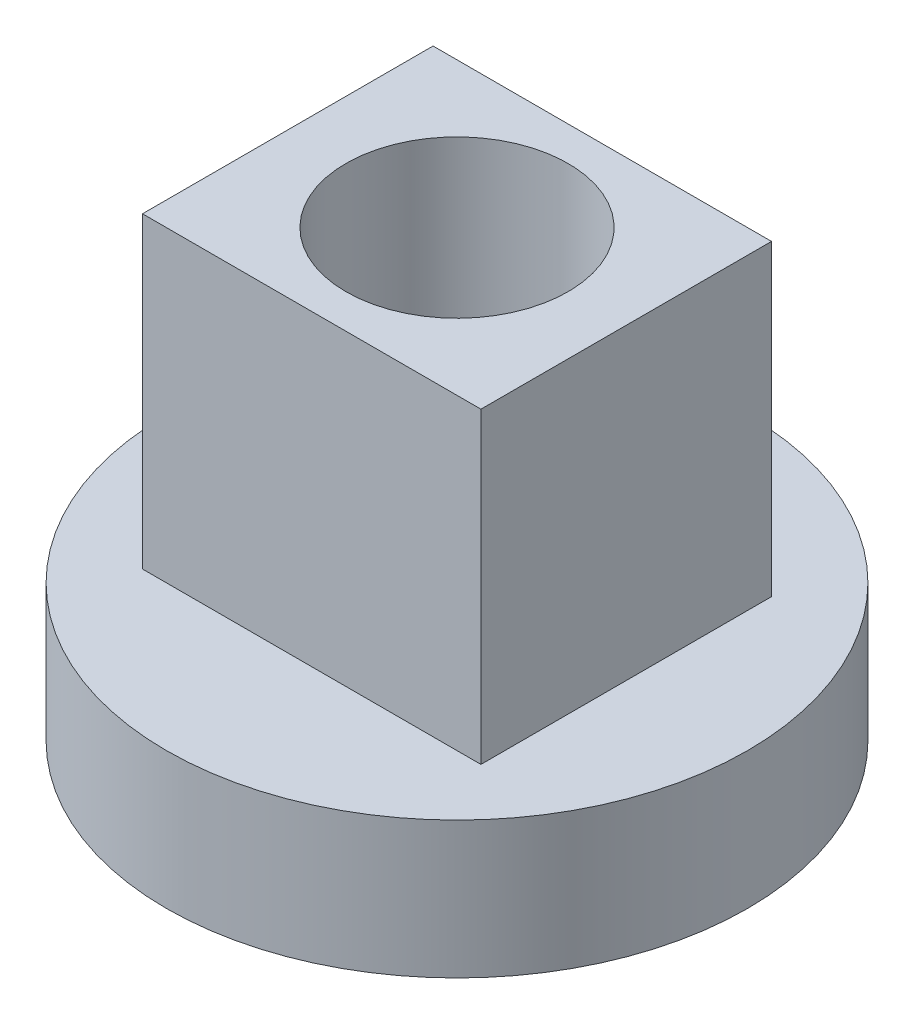
ISO-10303-21;
HEADER;
FILE_DESCRIPTION(('STEP AP214'),'2;1');
FILE_NAME('part.step','',(''),(''),'','','');
FILE_SCHEMA(('AUTOMOTIVE_DESIGN { 1 0 10303 214 1 1 1 1 }'));
ENDSEC;
DATA;
#1=APPLICATION_CONTEXT('core data for automotive mechanical design processes');
#2=APPLICATION_PROTOCOL_DEFINITION('international standard','automotive_design',2000,#1);
#3=PRODUCT_CONTEXT('',#1,'mechanical');
#4=PRODUCT('Part','Part','',(#3));
#5=PRODUCT_RELATED_PRODUCT_CATEGORY('part','',(#4));
#6=PRODUCT_DEFINITION_FORMATION('','',#4);
#7=PRODUCT_DEFINITION_CONTEXT('part definition',#1,'design');
#8=PRODUCT_DEFINITION('design','',#6,#7);
#9=PRODUCT_DEFINITION_SHAPE('','',#8);
#10=(LENGTH_UNIT() NAMED_UNIT(*) SI_UNIT(.MILLI.,.METRE.));
#11=(NAMED_UNIT(*) PLANE_ANGLE_UNIT() SI_UNIT($,.RADIAN.));
#12=(NAMED_UNIT(*) SI_UNIT($,.STERADIAN.) SOLID_ANGLE_UNIT());
#13=UNCERTAINTY_MEASURE_WITH_UNIT(LENGTH_MEASURE(1.E-05),#10,'distance_accuracy_value','');
#14=(GEOMETRIC_REPRESENTATION_CONTEXT(3) GLOBAL_UNCERTAINTY_ASSIGNED_CONTEXT((#13)) GLOBAL_UNIT_ASSIGNED_CONTEXT((#10,
#11,#12)) REPRESENTATION_CONTEXT('',''));
#15=CARTESIAN_POINT('',(0.,0.,0.));
#16=DIRECTION('',(0.,0.,1.));
#17=DIRECTION('',(1.,0.,0.));
#18=AXIS2_PLACEMENT_3D('',#15,#16,#17);
#19=CARTESIAN_POINT('',(0.,2.032,0.));
#20=DIRECTION('',(0.,-1.,0.));
#21=DIRECTION('',(0.,0.,-1.));
#22=AXIS2_PLACEMENT_3D('',#19,#20,#21);
#23=CYLINDRICAL_SURFACE('',#22,4.318);
#24=CARTESIAN_POINT('',(0.,2.032,0.));
#25=DIRECTION('',(0.,1.,0.));
#26=DIRECTION('',(0.,0.,1.));
#27=AXIS2_PLACEMENT_3D('',#24,#25,#26);
#28=CIRCLE('',#27,4.318);
#29=CARTESIAN_POINT('',(0.,2.032,4.318));
#30=VERTEX_POINT('',#29);
#31=EDGE_CURVE('E11',#30,#30,#28,.T.);
#32=ORIENTED_EDGE('',*,*,#31,.F.);
#33=EDGE_LOOP('',(#32));
#34=FACE_BOUND('',#33,.T.);
#35=CARTESIAN_POINT('',(0.,0.,0.));
#36=DIRECTION('',(0.,1.,0.));
#37=DIRECTION('',(0.,0.,1.));
#38=AXIS2_PLACEMENT_3D('',#35,#36,#37);
#39=CIRCLE('',#38,4.318);
#40=CARTESIAN_POINT('',(0.,0.,4.318));
#41=VERTEX_POINT('',#40);
#42=EDGE_CURVE('E39',#41,#41,#39,.T.);
#43=ORIENTED_EDGE('',*,*,#42,.T.);
#44=EDGE_LOOP('',(#43));
#45=FACE_BOUND('',#44,.T.);
#46=ADVANCED_FACE('F36',(#34,#45),#23,.T.);
#47=CARTESIAN_POINT('',(0.,2.032,0.));
#48=DIRECTION('',(0.,1.,0.));
#49=DIRECTION('',(0.,0.,1.));
#50=AXIS2_PLACEMENT_3D('',#47,#48,#49);
#51=PLANE('',#50);
#52=DIRECTION('',(0.,0.,-1.));
#53=VECTOR('',#52,1.);
#54=CARTESIAN_POINT('',(2.5146,2.032,-2.159));
#55=LINE('',#54,#53);
#56=CARTESIAN_POINT('',(2.5146,2.032,2.159));
#57=VERTEX_POINT('',#56);
#58=CARTESIAN_POINT('',(2.5146,2.032,-2.159));
#59=VERTEX_POINT('',#58);
#60=EDGE_CURVE('E50',#57,#59,#55,.T.);
#61=ORIENTED_EDGE('',*,*,#60,.F.);
#62=DIRECTION('',(1.,0.,0.));
#63=VECTOR('',#62,1.);
#64=CARTESIAN_POINT('',(-2.5146,2.032,2.159));
#65=LINE('',#64,#63);
#66=CARTESIAN_POINT('',(-2.5146,2.032,2.159));
#67=VERTEX_POINT('',#66);
#68=EDGE_CURVE('E54',#67,#57,#65,.T.);
#69=ORIENTED_EDGE('',*,*,#68,.F.);
#70=DIRECTION('',(0.,0.,1.));
#71=VECTOR('',#70,1.);
#72=CARTESIAN_POINT('',(-2.5146,2.032,-2.159));
#73=LINE('',#72,#71);
#74=CARTESIAN_POINT('',(-2.5146,2.032,-2.159));
#75=VERTEX_POINT('',#74);
#76=EDGE_CURVE('E106',#75,#67,#73,.T.);
#77=ORIENTED_EDGE('',*,*,#76,.F.);
#78=DIRECTION('',(-1.,0.,0.));
#79=VECTOR('',#78,1.);
#80=CARTESIAN_POINT('',(-2.5146,2.032,-2.159));
#81=LINE('',#80,#79);
#82=EDGE_CURVE('E108',#59,#75,#81,.T.);
#83=ORIENTED_EDGE('',*,*,#82,.F.);
#84=EDGE_LOOP('',(#61,#69,#77,#83));
#85=FACE_BOUND('',#84,.T.);
#86=ORIENTED_EDGE('',*,*,#31,.T.);
#87=EDGE_LOOP('',(#86));
#88=FACE_BOUND('',#87,.T.);
#89=ADVANCED_FACE('F139',(#85,#88),#51,.T.);
#90=CARTESIAN_POINT('',(0.,0.,0.));
#91=DIRECTION('',(0.,1.,0.));
#92=DIRECTION('',(0.,0.,1.));
#93=AXIS2_PLACEMENT_3D('',#90,#91,#92);
#94=PLANE('',#93);
#95=CARTESIAN_POINT('',(0.,0.,0.));
#96=DIRECTION('',(0.,1.,0.));
#97=DIRECTION('',(0.,0.,1.));
#98=AXIS2_PLACEMENT_3D('',#95,#96,#97);
#99=CIRCLE('',#98,1.651);
#100=CARTESIAN_POINT('',(0.,0.,1.651));
#101=VERTEX_POINT('',#100);
#102=EDGE_CURVE('E111',#101,#101,#99,.T.);
#103=ORIENTED_EDGE('',*,*,#102,.T.);
#104=EDGE_LOOP('',(#103));
#105=FACE_BOUND('',#104,.T.);
#106=ORIENTED_EDGE('',*,*,#42,.F.);
#107=EDGE_LOOP('',(#106));
#108=FACE_BOUND('',#107,.T.);
#109=ADVANCED_FACE('F120',(#105,#108),#94,.F.);
#110=CARTESIAN_POINT('',(2.5146,6.604,-2.159));
#111=DIRECTION('',(-1.,0.,0.));
#112=DIRECTION('',(0.,0.,1.));
#113=AXIS2_PLACEMENT_3D('',#110,#111,#112);
#114=PLANE('',#113);
#115=ORIENTED_EDGE('',*,*,#60,.T.);
#116=DIRECTION('',(0.,-1.,0.));
#117=VECTOR('',#116,1.);
#118=CARTESIAN_POINT('',(2.5146,6.604,-2.159));
#119=LINE('',#118,#117);
#120=CARTESIAN_POINT('',(2.5146,6.604,-2.159));
#121=VERTEX_POINT('',#120);
#122=EDGE_CURVE('E79',#121,#59,#119,.T.);
#123=ORIENTED_EDGE('',*,*,#122,.F.);
#124=DIRECTION('',(0.,0.,-1.));
#125=VECTOR('',#124,1.);
#126=CARTESIAN_POINT('',(2.5146,6.604,-2.159));
#127=LINE('',#126,#125);
#128=CARTESIAN_POINT('',(2.5146,6.604,2.159));
#129=VERTEX_POINT('',#128);
#130=EDGE_CURVE('E85',#129,#121,#127,.T.);
#131=ORIENTED_EDGE('',*,*,#130,.F.);
#132=DIRECTION('',(0.,-1.,0.));
#133=VECTOR('',#132,1.);
#134=CARTESIAN_POINT('',(2.5146,6.604,2.159));
#135=LINE('',#134,#133);
#136=EDGE_CURVE('E103',#129,#57,#135,.T.);
#137=ORIENTED_EDGE('',*,*,#136,.T.);
#138=EDGE_LOOP('',(#115,#123,#131,#137));
#139=FACE_BOUND('',#138,.T.);
#140=ADVANCED_FACE('F95',(#139),#114,.F.);
#141=CARTESIAN_POINT('',(-2.5146,6.604,-2.159));
#142=DIRECTION('',(0.,0.,1.));
#143=DIRECTION('',(1.,0.,0.));
#144=AXIS2_PLACEMENT_3D('',#141,#142,#143);
#145=PLANE('',#144);
#146=ORIENTED_EDGE('',*,*,#82,.T.);
#147=DIRECTION('',(0.,-1.,0.));
#148=VECTOR('',#147,1.);
#149=CARTESIAN_POINT('',(-2.5146,6.604,-2.159));
#150=LINE('',#149,#148);
#151=CARTESIAN_POINT('',(-2.5146,6.604,-2.159));
#152=VERTEX_POINT('',#151);
#153=EDGE_CURVE('E81',#152,#75,#150,.T.);
#154=ORIENTED_EDGE('',*,*,#153,.F.);
#155=DIRECTION('',(-1.,0.,0.));
#156=VECTOR('',#155,1.);
#157=CARTESIAN_POINT('',(-2.5146,6.604,-2.159));
#158=LINE('',#157,#156);
#159=EDGE_CURVE('E74',#121,#152,#158,.T.);
#160=ORIENTED_EDGE('',*,*,#159,.F.);
#161=ORIENTED_EDGE('',*,*,#122,.T.);
#162=EDGE_LOOP('',(#146,#154,#160,#161));
#163=FACE_BOUND('',#162,.T.);
#164=ADVANCED_FACE('F77',(#163),#145,.F.);
#165=CARTESIAN_POINT('',(-2.5146,6.604,-2.159));
#166=DIRECTION('',(1.,0.,0.));
#167=DIRECTION('',(0.,0.,-1.));
#168=AXIS2_PLACEMENT_3D('',#165,#166,#167);
#169=PLANE('',#168);
#170=ORIENTED_EDGE('',*,*,#76,.T.);
#171=DIRECTION('',(0.,-1.,0.));
#172=VECTOR('',#171,1.);
#173=CARTESIAN_POINT('',(-2.5146,6.604,2.159));
#174=LINE('',#173,#172);
#175=CARTESIAN_POINT('',(-2.5146,6.604,2.159));
#176=VERTEX_POINT('',#175);
#177=EDGE_CURVE('E98',#176,#67,#174,.T.);
#178=ORIENTED_EDGE('',*,*,#177,.F.);
#179=DIRECTION('',(0.,0.,1.));
#180=VECTOR('',#179,1.);
#181=CARTESIAN_POINT('',(-2.5146,6.604,-2.159));
#182=LINE('',#181,#180);
#183=EDGE_CURVE('E84',#152,#176,#182,.T.);
#184=ORIENTED_EDGE('',*,*,#183,.F.);
#185=ORIENTED_EDGE('',*,*,#153,.T.);
#186=EDGE_LOOP('',(#170,#178,#184,#185));
#187=FACE_BOUND('',#186,.T.);
#188=ADVANCED_FACE('F135',(#187),#169,.F.);
#189=CARTESIAN_POINT('',(-2.5146,6.604,2.159));
#190=DIRECTION('',(0.,0.,-1.));
#191=DIRECTION('',(-1.,0.,0.));
#192=AXIS2_PLACEMENT_3D('',#189,#190,#191);
#193=PLANE('',#192);
#194=ORIENTED_EDGE('',*,*,#68,.T.);
#195=ORIENTED_EDGE('',*,*,#136,.F.);
#196=DIRECTION('',(1.,0.,0.));
#197=VECTOR('',#196,1.);
#198=CARTESIAN_POINT('',(-2.5146,6.604,2.159));
#199=LINE('',#198,#197);
#200=EDGE_CURVE('E90',#176,#129,#199,.T.);
#201=ORIENTED_EDGE('',*,*,#200,.F.);
#202=ORIENTED_EDGE('',*,*,#177,.T.);
#203=EDGE_LOOP('',(#194,#195,#201,#202));
#204=FACE_BOUND('',#203,.T.);
#205=ADVANCED_FACE('F130',(#204),#193,.F.);
#206=CARTESIAN_POINT('',(0.,6.604,0.));
#207=DIRECTION('',(0.,1.,0.));
#208=DIRECTION('',(0.,0.,1.));
#209=AXIS2_PLACEMENT_3D('',#206,#207,#208);
#210=PLANE('',#209);
#211=CARTESIAN_POINT('',(0.,6.604,0.));
#212=DIRECTION('',(0.,1.,0.));
#213=DIRECTION('',(0.,0.,1.));
#214=AXIS2_PLACEMENT_3D('',#211,#212,#213);
#215=CIRCLE('',#214,1.651);
#216=CARTESIAN_POINT('',(0.,6.604,1.651));
#217=VERTEX_POINT('',#216);
#218=EDGE_CURVE('E114',#217,#217,#215,.T.);
#219=ORIENTED_EDGE('',*,*,#218,.F.);
#220=EDGE_LOOP('',(#219));
#221=FACE_BOUND('',#220,.T.);
#222=ORIENTED_EDGE('',*,*,#130,.T.);
#223=ORIENTED_EDGE('',*,*,#159,.T.);
#224=ORIENTED_EDGE('',*,*,#183,.T.);
#225=ORIENTED_EDGE('',*,*,#200,.T.);
#226=EDGE_LOOP('',(#222,#223,#224,#225));
#227=FACE_BOUND('',#226,.T.);
#228=ADVANCED_FACE('F88',(#221,#227),#210,.T.);
#229=CARTESIAN_POINT('',(0.,0.,0.));
#230=DIRECTION('',(0.,1.,0.));
#231=DIRECTION('',(0.,0.,1.));
#232=AXIS2_PLACEMENT_3D('',#229,#230,#231);
#233=CYLINDRICAL_SURFACE('',#232,1.651);
#234=ORIENTED_EDGE('',*,*,#102,.F.);
#235=EDGE_LOOP('',(#234));
#236=FACE_BOUND('',#235,.T.);
#237=ORIENTED_EDGE('',*,*,#218,.T.);
#238=EDGE_LOOP('',(#237));
#239=FACE_BOUND('',#238,.T.);
#240=ADVANCED_FACE('F123',(#236,#239),#233,.F.);
#241=CLOSED_SHELL('',(#46,#89,#109,#140,#164,#188,#205,#228,#240));
#242=MANIFOLD_SOLID_BREP('B2',#241);
#243=ADVANCED_BREP_SHAPE_REPRESENTATION('',(#18,#242),#14);
#244=SHAPE_DEFINITION_REPRESENTATION(#9,#243);
ENDSEC;
END-ISO-10303-21;
